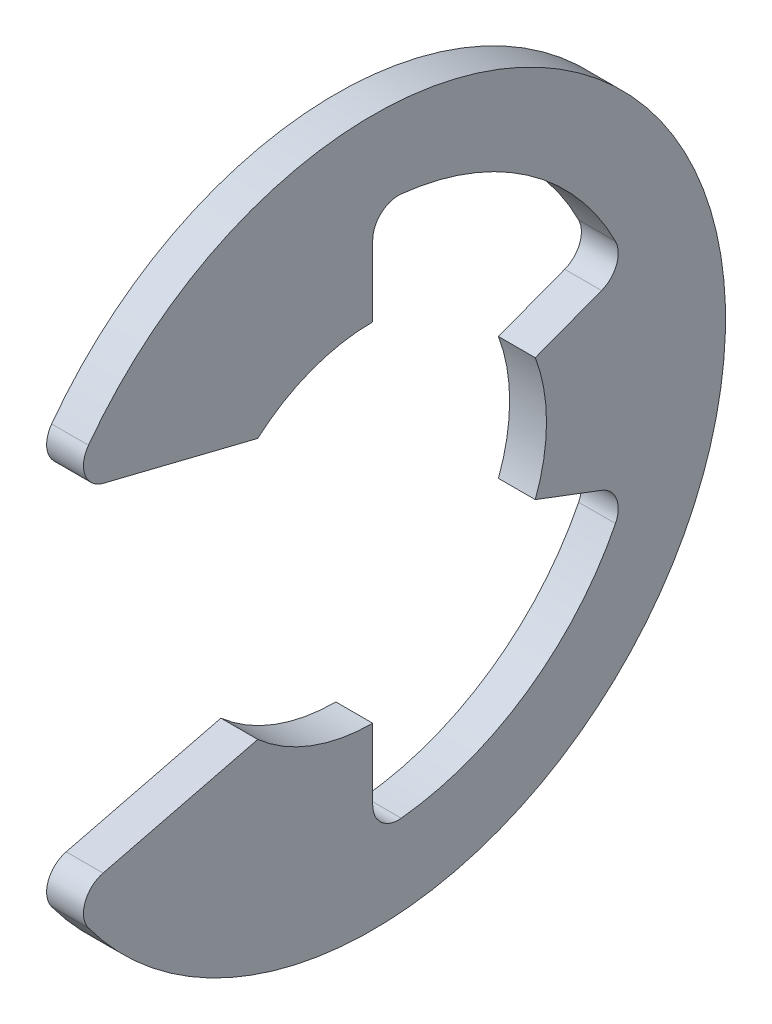
ISO-10303-21;
HEADER;
FILE_DESCRIPTION(('STEP AP214'),'2;1');
FILE_NAME('part.step','',(''),(''),'','','');
FILE_SCHEMA(('AUTOMOTIVE_DESIGN { 1 0 10303 214 1 1 1 1 }'));
ENDSEC;
DATA;
#1=APPLICATION_CONTEXT('core data for automotive mechanical design processes');
#2=APPLICATION_PROTOCOL_DEFINITION('international standard','automotive_design',2000,#1);
#3=PRODUCT_CONTEXT('',#1,'mechanical');
#4=PRODUCT('Part','Part','',(#3));
#5=PRODUCT_RELATED_PRODUCT_CATEGORY('part','',(#4));
#6=PRODUCT_DEFINITION_FORMATION('','',#4);
#7=PRODUCT_DEFINITION_CONTEXT('part definition',#1,'design');
#8=PRODUCT_DEFINITION('design','',#6,#7);
#9=PRODUCT_DEFINITION_SHAPE('','',#8);
#10=(LENGTH_UNIT() NAMED_UNIT(*) SI_UNIT(.MILLI.,.METRE.));
#11=(NAMED_UNIT(*) PLANE_ANGLE_UNIT() SI_UNIT($,.RADIAN.));
#12=(NAMED_UNIT(*) SI_UNIT($,.STERADIAN.) SOLID_ANGLE_UNIT());
#13=UNCERTAINTY_MEASURE_WITH_UNIT(LENGTH_MEASURE(1.E-05),#10,'distance_accuracy_value','');
#14=(GEOMETRIC_REPRESENTATION_CONTEXT(3) GLOBAL_UNCERTAINTY_ASSIGNED_CONTEXT((#13)) GLOBAL_UNIT_ASSIGNED_CONTEXT((#10,
#11,#12)) REPRESENTATION_CONTEXT('',''));
#15=CARTESIAN_POINT('',(0.,0.,0.));
#16=DIRECTION('',(0.,0.,1.));
#17=DIRECTION('',(1.,0.,0.));
#18=AXIS2_PLACEMENT_3D('',#15,#16,#17);
#19=CARTESIAN_POINT('',(0.5334,0.,0.));
#20=DIRECTION('',(1.,0.,0.));
#21=DIRECTION('',(0.,0.,-1.));
#22=AXIS2_PLACEMENT_3D('',#19,#20,#21);
#23=PLANE('',#22);
#24=DIRECTION('',(0.,-1.,0.));
#25=VECTOR('',#24,1.);
#26=CARTESIAN_POINT('',(0.5334,-5.0292,0.));
#27=LINE('',#26,#25);
#28=CARTESIAN_POINT('',(0.5334,-7.07977202193844,0.));
#29=VERTEX_POINT('',#28);
#30=CARTESIAN_POINT('',(0.5334,-5.0292,0.));
#31=VERTEX_POINT('',#30);
#32=EDGE_CURVE('E167',#29,#31,#27,.F.);
#33=ORIENTED_EDGE('',*,*,#32,.T.);
#34=CARTESIAN_POINT('',(0.5334,0.,0.));
#35=DIRECTION('',(-1.,0.,0.));
#36=DIRECTION('',(0.,0.,1.));
#37=AXIS2_PLACEMENT_3D('',#34,#35,#36);
#38=CIRCLE('',#37,5.0292);
#39=CARTESIAN_POINT('',(0.5334,-3.7719,3.32650312340151));
#40=VERTEX_POINT('',#39);
#41=EDGE_CURVE('E223',#31,#40,#38,.T.);
#42=ORIENTED_EDGE('',*,*,#41,.T.);
#43=DIRECTION('',(0.,0.240952820606873,-0.970536829925373));
#44=VECTOR('',#43,1.);
#45=CARTESIAN_POINT('',(0.5334,-5.13688856516319,8.82455735485331));
#46=LINE('',#45,#44);
#47=CARTESIAN_POINT('',(0.5334,-4.88336468232429,7.80338538873514));
#48=VERTEX_POINT('',#47);
#49=EDGE_CURVE('E162',#40,#48,#46,.F.);
#50=ORIENTED_EDGE('',*,*,#49,.T.);
#51=CARTESIAN_POINT('',(0.5334,-5.60812276543936,7.62345146041875));
#52=DIRECTION('',(-1.,0.,0.));
#53=DIRECTION('',(0.,0.,1.));
#54=AXIS2_PLACEMENT_3D('',#51,#52,#53);
#55=CIRCLE('',#54,0.746760000000001);
#56=CARTESIAN_POINT('',(0.5334,-6.05063164709239,8.22497983652265));
#57=VERTEX_POINT('',#56);
#58=EDGE_CURVE('E221',#57,#48,#55,.T.);
#59=ORIENTED_EDGE('',*,*,#58,.F.);
#60=CARTESIAN_POINT('',(0.5334,0.,0.));
#61=DIRECTION('',(-1.,0.,0.));
#62=DIRECTION('',(0.,0.,1.));
#63=AXIS2_PLACEMENT_3D('',#60,#61,#62);
#64=CIRCLE('',#63,10.2108);
#65=CARTESIAN_POINT('',(0.5334,6.05063164709238,8.22497983652265));
#66=VERTEX_POINT('',#65);
#67=EDGE_CURVE('E142',#66,#57,#64,.T.);
#68=ORIENTED_EDGE('',*,*,#67,.F.);
#69=CARTESIAN_POINT('',(0.5334,5.60812276543936,7.62345146041875));
#70=DIRECTION('',(-1.,0.,0.));
#71=DIRECTION('',(0.,0.,1.));
#72=AXIS2_PLACEMENT_3D('',#69,#70,#71);
#73=CIRCLE('',#72,0.74676);
#74=CARTESIAN_POINT('',(0.5334,4.88336468232429,7.80338538873514));
#75=VERTEX_POINT('',#74);
#76=EDGE_CURVE('E20',#75,#66,#73,.T.);
#77=ORIENTED_EDGE('',*,*,#76,.F.);
#78=DIRECTION('',(0.,0.240952820606873,0.970536829925373));
#79=VECTOR('',#78,1.);
#80=CARTESIAN_POINT('',(0.5334,5.13688856516319,8.82455735485332));
#81=LINE('',#80,#79);
#82=CARTESIAN_POINT('',(0.5334,3.7719,3.32650312340151));
#83=VERTEX_POINT('',#82);
#84=EDGE_CURVE('E139',#75,#83,#81,.F.);
#85=ORIENTED_EDGE('',*,*,#84,.T.);
#86=CARTESIAN_POINT('',(0.5334,0.,0.));
#87=DIRECTION('',(-1.,0.,0.));
#88=DIRECTION('',(0.,0.,1.));
#89=AXIS2_PLACEMENT_3D('',#86,#87,#88);
#90=CIRCLE('',#89,5.0292);
#91=CARTESIAN_POINT('',(0.5334,5.0292,0.));
#92=VERTEX_POINT('',#91);
#93=EDGE_CURVE('E242',#83,#92,#90,.T.);
#94=ORIENTED_EDGE('',*,*,#93,.T.);
#95=DIRECTION('',(0.,-1.,0.));
#96=VECTOR('',#95,1.);
#97=CARTESIAN_POINT('',(0.5334,5.0292,0.));
#98=LINE('',#97,#96);
#99=CARTESIAN_POINT('',(0.5334,7.07977202193844,0.));
#100=VERTEX_POINT('',#99);
#101=EDGE_CURVE('E179',#92,#100,#98,.F.);
#102=ORIENTED_EDGE('',*,*,#101,.T.);
#103=CARTESIAN_POINT('',(0.5334,7.07977202193844,-0.746759999999999));
#104=DIRECTION('',(-1.,0.,0.));
#105=DIRECTION('',(0.,0.,1.));
#106=AXIS2_PLACEMENT_3D('',#103,#104,#105);
#107=CIRCLE('',#106,0.74676);
#108=CARTESIAN_POINT('',(0.5334,7.82241228858608,-0.825092189765899));
#109=VERTEX_POINT('',#108);
#110=EDGE_CURVE('E241',#100,#109,#107,.T.);
#111=ORIENTED_EDGE('',*,*,#110,.T.);
#112=CARTESIAN_POINT('',(0.5334,0.,0.));
#113=DIRECTION('',(-1.,0.,0.));
#114=DIRECTION('',(0.,0.,1.));
#115=AXIS2_PLACEMENT_3D('',#112,#113,#114);
#116=CIRCLE('',#115,7.8658064516129);
#117=CARTESIAN_POINT('',(0.5334,3.53744345889987,-7.02548253925108));
#118=VERTEX_POINT('',#117);
#119=EDGE_CURVE('E238',#109,#118,#116,.T.);
#120=ORIENTED_EDGE('',*,*,#119,.T.);
#121=CARTESIAN_POINT('',(0.5334,3.20160742052056,-6.35850079068093));
#122=DIRECTION('',(-1.,0.,0.));
#123=DIRECTION('',(0.,0.,1.));
#124=AXIS2_PLACEMENT_3D('',#121,#122,#123);
#125=CIRCLE('',#124,0.74676);
#126=CARTESIAN_POINT('',(0.5334,2.50307740298373,-6.62252032064036));
#127=VERTEX_POINT('',#126);
#128=EDGE_CURVE('E235',#118,#127,#125,.T.);
#129=ORIENTED_EDGE('',*,*,#128,.T.);
#130=DIRECTION('',(0.,0.353553390593273,-0.935414346693486));
#131=VECTOR('',#130,1.);
#132=CARTESIAN_POINT('',(0.5334,1.77809071197169,-4.70438583239088));
#133=LINE('',#132,#131);
#134=CARTESIAN_POINT('',(0.5334,1.77809071197169,-4.70438583239087));
#135=VERTEX_POINT('',#134);
#136=EDGE_CURVE('E175',#127,#135,#133,.F.);
#137=ORIENTED_EDGE('',*,*,#136,.T.);
#138=CARTESIAN_POINT('',(0.5334,0.,0.));
#139=DIRECTION('',(-1.,0.,0.));
#140=DIRECTION('',(0.,0.,1.));
#141=AXIS2_PLACEMENT_3D('',#138,#139,#140);
#142=CIRCLE('',#141,5.0292);
#143=CARTESIAN_POINT('',(0.5334,-1.77809071197169,-4.70438583239088));
#144=VERTEX_POINT('',#143);
#145=EDGE_CURVE('E233',#135,#144,#142,.T.);
#146=ORIENTED_EDGE('',*,*,#145,.T.);
#147=DIRECTION('',(0.,0.353553390593273,0.935414346693486));
#148=VECTOR('',#147,1.);
#149=CARTESIAN_POINT('',(0.5334,-1.77809071197169,-4.70438583239088));
#150=LINE('',#149,#148);
#151=CARTESIAN_POINT('',(0.5334,-2.50307740298373,-6.62252032064036));
#152=VERTEX_POINT('',#151);
#153=EDGE_CURVE('E171',#144,#152,#150,.F.);
#154=ORIENTED_EDGE('',*,*,#153,.T.);
#155=CARTESIAN_POINT('',(0.5334,-3.20160742052056,-6.35850079068093));
#156=DIRECTION('',(-1.,0.,0.));
#157=DIRECTION('',(0.,0.,1.));
#158=AXIS2_PLACEMENT_3D('',#155,#156,#157);
#159=CIRCLE('',#158,0.74676);
#160=CARTESIAN_POINT('',(0.5334,-3.53744345889986,-7.02548253925108));
#161=VERTEX_POINT('',#160);
#162=EDGE_CURVE('E231',#152,#161,#159,.T.);
#163=ORIENTED_EDGE('',*,*,#162,.T.);
#164=CARTESIAN_POINT('',(0.5334,0.,0.));
#165=DIRECTION('',(-1.,0.,0.));
#166=DIRECTION('',(0.,0.,1.));
#167=AXIS2_PLACEMENT_3D('',#164,#165,#166);
#168=CIRCLE('',#167,7.8658064516129);
#169=CARTESIAN_POINT('',(0.5334,-7.82241228858608,-0.825092189765901));
#170=VERTEX_POINT('',#169);
#171=EDGE_CURVE('E228',#161,#170,#168,.T.);
#172=ORIENTED_EDGE('',*,*,#171,.T.);
#173=CARTESIAN_POINT('',(0.5334,-7.07977202193844,-0.74676));
#174=DIRECTION('',(-1.,0.,0.));
#175=DIRECTION('',(0.,0.,1.));
#176=AXIS2_PLACEMENT_3D('',#173,#174,#175);
#177=CIRCLE('',#176,0.74676);
#178=EDGE_CURVE('E225',#170,#29,#177,.T.);
#179=ORIENTED_EDGE('',*,*,#178,.T.);
#180=EDGE_LOOP('',(#33,#42,#50,#59,#68,#77,#85,#94,#102,#111,#120,#129,#137,#146,#154,#163,#172,#179));
#181=FACE_BOUND('',#180,.T.);
#182=ADVANCED_FACE('F17',(#181),#23,.T.);
#183=CARTESIAN_POINT('',(0.5334,5.60812276543936,7.62345146041875));
#184=DIRECTION('',(-1.,0.,0.));
#185=DIRECTION('',(0.,0.,1.));
#186=AXIS2_PLACEMENT_3D('',#183,#184,#185);
#187=CYLINDRICAL_SURFACE('',#186,0.74676);
#188=CARTESIAN_POINT('',(-0.5334,5.60812276543936,7.62345146041875));
#189=DIRECTION('',(-1.,0.,0.));
#190=DIRECTION('',(0.,0.,1.));
#191=AXIS2_PLACEMENT_3D('',#188,#189,#190);
#192=CIRCLE('',#191,0.74676);
#193=CARTESIAN_POINT('',(-0.5334,6.05063164709238,8.22497983652265));
#194=VERTEX_POINT('',#193);
#195=CARTESIAN_POINT('',(-0.5334,4.88336468232429,7.80338538873514));
#196=VERTEX_POINT('',#195);
#197=EDGE_CURVE('E157',#194,#196,#192,.F.);
#198=ORIENTED_EDGE('',*,*,#197,.T.);
#199=DIRECTION('',(1.,0.,0.));
#200=VECTOR('',#199,1.);
#201=CARTESIAN_POINT('',(0.5334,4.88336468232429,7.80338538873514));
#202=LINE('',#201,#200);
#203=EDGE_CURVE('E147',#196,#75,#202,.T.);
#204=ORIENTED_EDGE('',*,*,#203,.T.);
#205=ORIENTED_EDGE('',*,*,#76,.T.);
#206=DIRECTION('',(-1.,0.,0.));
#207=VECTOR('',#206,1.);
#208=CARTESIAN_POINT('',(0.5334,6.05063164709238,8.22497983652265));
#209=LINE('',#208,#207);
#210=EDGE_CURVE('E218',#194,#66,#209,.F.);
#211=ORIENTED_EDGE('',*,*,#210,.F.);
#212=EDGE_LOOP('',(#198,#204,#205,#211));
#213=FACE_BOUND('',#212,.T.);
#214=ADVANCED_FACE('F156',(#213),#187,.T.);
#215=CARTESIAN_POINT('',(0.5334,5.13688856516319,8.82455735485332));
#216=DIRECTION('',(0.,0.970536829925373,-0.240952820606873));
#217=DIRECTION('',(0.,0.240952820606873,0.970536829925373));
#218=AXIS2_PLACEMENT_3D('',#215,#216,#217);
#219=PLANE('',#218);
#220=ORIENTED_EDGE('',*,*,#203,.F.);
#221=DIRECTION('',(0.,-0.240952820606873,-0.970536829925373));
#222=VECTOR('',#221,1.);
#223=CARTESIAN_POINT('',(-0.5334,4.88336468232429,7.80338538873514));
#224=LINE('',#223,#222);
#225=CARTESIAN_POINT('',(-0.5334,3.7719,3.32650312340151));
#226=VERTEX_POINT('',#225);
#227=EDGE_CURVE('E216',#196,#226,#224,.T.);
#228=ORIENTED_EDGE('',*,*,#227,.T.);
#229=DIRECTION('',(-1.,0.,0.));
#230=VECTOR('',#229,1.);
#231=CARTESIAN_POINT('',(0.5334,3.7719,3.32650312340151));
#232=LINE('',#231,#230);
#233=EDGE_CURVE('E154',#226,#83,#232,.F.);
#234=ORIENTED_EDGE('',*,*,#233,.T.);
#235=ORIENTED_EDGE('',*,*,#84,.F.);
#236=EDGE_LOOP('',(#220,#228,#234,#235));
#237=FACE_BOUND('',#236,.T.);
#238=ADVANCED_FACE('F151',(#237),#219,.F.);
#239=CARTESIAN_POINT('',(0.5334,0.,0.));
#240=DIRECTION('',(-1.,0.,0.));
#241=DIRECTION('',(0.,0.,1.));
#242=AXIS2_PLACEMENT_3D('',#239,#240,#241);
#243=CYLINDRICAL_SURFACE('',#242,5.0292);
#244=DIRECTION('',(1.,0.,0.));
#245=VECTOR('',#244,1.);
#246=CARTESIAN_POINT('',(0.5334,5.0292,0.));
#247=LINE('',#246,#245);
#248=CARTESIAN_POINT('',(-0.5334,5.0292,0.));
#249=VERTEX_POINT('',#248);
#250=EDGE_CURVE('E181',#249,#92,#247,.T.);
#251=ORIENTED_EDGE('',*,*,#250,.T.);
#252=ORIENTED_EDGE('',*,*,#93,.F.);
#253=ORIENTED_EDGE('',*,*,#233,.F.);
#254=CARTESIAN_POINT('',(-0.5334,0.,0.));
#255=DIRECTION('',(-1.,0.,0.));
#256=DIRECTION('',(0.,0.,1.));
#257=AXIS2_PLACEMENT_3D('',#254,#255,#256);
#258=CIRCLE('',#257,5.0292);
#259=EDGE_CURVE('E213',#226,#249,#258,.T.);
#260=ORIENTED_EDGE('',*,*,#259,.T.);
#261=EDGE_LOOP('',(#251,#252,#253,#260));
#262=FACE_BOUND('',#261,.T.);
#263=ADVANCED_FACE('F340',(#262),#243,.F.);
#264=CARTESIAN_POINT('',(0.5334,5.0292,0.));
#265=DIRECTION('',(0.,0.,1.));
#266=DIRECTION('',(0.,-1.,0.));
#267=AXIS2_PLACEMENT_3D('',#264,#265,#266);
#268=PLANE('',#267);
#269=DIRECTION('',(-1.,0.,0.));
#270=VECTOR('',#269,1.);
#271=CARTESIAN_POINT('',(0.5334,7.07977202193844,0.));
#272=LINE('',#271,#270);
#273=CARTESIAN_POINT('',(-0.5334,7.07977202193844,0.));
#274=VERTEX_POINT('',#273);
#275=EDGE_CURVE('E180',#274,#100,#272,.F.);
#276=ORIENTED_EDGE('',*,*,#275,.T.);
#277=ORIENTED_EDGE('',*,*,#101,.F.);
#278=ORIENTED_EDGE('',*,*,#250,.F.);
#279=DIRECTION('',(0.,1.,0.));
#280=VECTOR('',#279,1.);
#281=CARTESIAN_POINT('',(-0.5334,0.,0.));
#282=LINE('',#281,#280);
#283=EDGE_CURVE('E212',#249,#274,#282,.T.);
#284=ORIENTED_EDGE('',*,*,#283,.T.);
#285=EDGE_LOOP('',(#276,#277,#278,#284));
#286=FACE_BOUND('',#285,.T.);
#287=ADVANCED_FACE('F338',(#286),#268,.F.);
#288=CARTESIAN_POINT('',(0.5334,7.07977202193844,-0.746759999999999));
#289=DIRECTION('',(-1.,0.,0.));
#290=DIRECTION('',(0.,0.,1.));
#291=AXIS2_PLACEMENT_3D('',#288,#289,#290);
#292=CYLINDRICAL_SURFACE('',#291,0.74676);
#293=ORIENTED_EDGE('',*,*,#275,.F.);
#294=CARTESIAN_POINT('',(-0.5334,7.07977202193844,-0.746759999999999));
#295=DIRECTION('',(-1.,0.,0.));
#296=DIRECTION('',(0.,0.,1.));
#297=AXIS2_PLACEMENT_3D('',#294,#295,#296);
#298=CIRCLE('',#297,0.74676);
#299=CARTESIAN_POINT('',(-0.5334,7.82241228858608,-0.825092189765899));
#300=VERTEX_POINT('',#299);
#301=EDGE_CURVE('E209',#274,#300,#298,.T.);
#302=ORIENTED_EDGE('',*,*,#301,.T.);
#303=DIRECTION('',(-1.,0.,0.));
#304=VECTOR('',#303,1.);
#305=CARTESIAN_POINT('',(0.5334,7.82241228858608,-0.8250921897659));
#306=LINE('',#305,#304);
#307=EDGE_CURVE('E240',#300,#109,#306,.F.);
#308=ORIENTED_EDGE('',*,*,#307,.T.);
#309=ORIENTED_EDGE('',*,*,#110,.F.);
#310=EDGE_LOOP('',(#293,#302,#308,#309));
#311=FACE_BOUND('',#310,.T.);
#312=ADVANCED_FACE('F335',(#311),#292,.F.);
#313=CARTESIAN_POINT('',(0.5334,0.,0.));
#314=DIRECTION('',(-1.,0.,0.));
#315=DIRECTION('',(0.,0.,1.));
#316=AXIS2_PLACEMENT_3D('',#313,#314,#315);
#317=CYLINDRICAL_SURFACE('',#316,7.8658064516129);
#318=ORIENTED_EDGE('',*,*,#307,.F.);
#319=CARTESIAN_POINT('',(-0.5334,0.,0.));
#320=DIRECTION('',(-1.,0.,0.));
#321=DIRECTION('',(0.,0.,1.));
#322=AXIS2_PLACEMENT_3D('',#319,#320,#321);
#323=CIRCLE('',#322,7.8658064516129);
#324=CARTESIAN_POINT('',(-0.5334,3.53744345889986,-7.02548253925108));
#325=VERTEX_POINT('',#324);
#326=EDGE_CURVE('E206',#300,#325,#323,.T.);
#327=ORIENTED_EDGE('',*,*,#326,.T.);
#328=DIRECTION('',(-1.,0.,0.));
#329=VECTOR('',#328,1.);
#330=CARTESIAN_POINT('',(0.5334,3.53744345889986,-7.02548253925108));
#331=LINE('',#330,#329);
#332=EDGE_CURVE('E237',#325,#118,#331,.F.);
#333=ORIENTED_EDGE('',*,*,#332,.T.);
#334=ORIENTED_EDGE('',*,*,#119,.F.);
#335=EDGE_LOOP('',(#318,#327,#333,#334));
#336=FACE_BOUND('',#335,.T.);
#337=ADVANCED_FACE('F331',(#336),#317,.F.);
#338=CARTESIAN_POINT('',(0.5334,3.20160742052056,-6.35850079068093));
#339=DIRECTION('',(-1.,0.,0.));
#340=DIRECTION('',(0.,0.,1.));
#341=AXIS2_PLACEMENT_3D('',#338,#339,#340);
#342=CYLINDRICAL_SURFACE('',#341,0.74676);
#343=ORIENTED_EDGE('',*,*,#332,.F.);
#344=CARTESIAN_POINT('',(-0.5334,3.20160742052056,-6.35850079068093));
#345=DIRECTION('',(-1.,0.,0.));
#346=DIRECTION('',(0.,0.,1.));
#347=AXIS2_PLACEMENT_3D('',#344,#345,#346);
#348=CIRCLE('',#347,0.74676);
#349=CARTESIAN_POINT('',(-0.5334,2.50307740298373,-6.62252032064036));
#350=VERTEX_POINT('',#349);
#351=EDGE_CURVE('E203',#325,#350,#348,.T.);
#352=ORIENTED_EDGE('',*,*,#351,.T.);
#353=DIRECTION('',(1.,0.,0.));
#354=VECTOR('',#353,1.);
#355=CARTESIAN_POINT('',(0.5334,2.50307740298373,-6.62252032064036));
#356=LINE('',#355,#354);
#357=EDGE_CURVE('E178',#350,#127,#356,.T.);
#358=ORIENTED_EDGE('',*,*,#357,.T.);
#359=ORIENTED_EDGE('',*,*,#128,.F.);
#360=EDGE_LOOP('',(#343,#352,#358,#359));
#361=FACE_BOUND('',#360,.T.);
#362=ADVANCED_FACE('F327',(#361),#342,.F.);
#363=CARTESIAN_POINT('',(0.5334,1.77809071197169,-4.70438583239088));
#364=DIRECTION('',(0.,-0.935414346693486,-0.353553390593273));
#365=DIRECTION('',(0.,0.353553390593273,-0.935414346693486));
#366=AXIS2_PLACEMENT_3D('',#363,#364,#365);
#367=PLANE('',#366);
#368=ORIENTED_EDGE('',*,*,#357,.F.);
#369=DIRECTION('',(0.,-0.353553390593273,0.935414346693486));
#370=VECTOR('',#369,1.);
#371=CARTESIAN_POINT('',(-0.5334,2.50307740298373,-6.62252032064036));
#372=LINE('',#371,#370);
#373=CARTESIAN_POINT('',(-0.5334,1.77809071197169,-4.70438583239087));
#374=VERTEX_POINT('',#373);
#375=EDGE_CURVE('E202',#350,#374,#372,.T.);
#376=ORIENTED_EDGE('',*,*,#375,.T.);
#377=DIRECTION('',(-1.,0.,0.));
#378=VECTOR('',#377,1.);
#379=CARTESIAN_POINT('',(0.5334,1.77809071197169,-4.70438583239087));
#380=LINE('',#379,#378);
#381=EDGE_CURVE('E177',#374,#135,#380,.F.);
#382=ORIENTED_EDGE('',*,*,#381,.T.);
#383=ORIENTED_EDGE('',*,*,#136,.F.);
#384=EDGE_LOOP('',(#368,#376,#382,#383));
#385=FACE_BOUND('',#384,.T.);
#386=ADVANCED_FACE('F323',(#385),#367,.F.);
#387=CARTESIAN_POINT('',(0.5334,0.,0.));
#388=DIRECTION('',(-1.,0.,0.));
#389=DIRECTION('',(0.,0.,1.));
#390=AXIS2_PLACEMENT_3D('',#387,#388,#389);
#391=CYLINDRICAL_SURFACE('',#390,5.0292);
#392=DIRECTION('',(1.,0.,0.));
#393=VECTOR('',#392,1.);
#394=CARTESIAN_POINT('',(0.5334,-1.77809071197169,-4.70438583239088));
#395=LINE('',#394,#393);
#396=CARTESIAN_POINT('',(-0.5334,-1.77809071197169,-4.70438583239088));
#397=VERTEX_POINT('',#396);
#398=EDGE_CURVE('E174',#397,#144,#395,.T.);
#399=ORIENTED_EDGE('',*,*,#398,.T.);
#400=ORIENTED_EDGE('',*,*,#145,.F.);
#401=ORIENTED_EDGE('',*,*,#381,.F.);
#402=CARTESIAN_POINT('',(-0.5334,0.,0.));
#403=DIRECTION('',(-1.,0.,0.));
#404=DIRECTION('',(0.,0.,1.));
#405=AXIS2_PLACEMENT_3D('',#402,#403,#404);
#406=CIRCLE('',#405,5.0292);
#407=EDGE_CURVE('E199',#374,#397,#406,.T.);
#408=ORIENTED_EDGE('',*,*,#407,.T.);
#409=EDGE_LOOP('',(#399,#400,#401,#408));
#410=FACE_BOUND('',#409,.T.);
#411=ADVANCED_FACE('F319',(#410),#391,.F.);
#412=CARTESIAN_POINT('',(0.5334,-1.77809071197169,-4.70438583239088));
#413=DIRECTION('',(0.,0.935414346693486,-0.353553390593273));
#414=DIRECTION('',(0.,0.353553390593273,0.935414346693486));
#415=AXIS2_PLACEMENT_3D('',#412,#413,#414);
#416=PLANE('',#415);
#417=DIRECTION('',(-1.,0.,0.));
#418=VECTOR('',#417,1.);
#419=CARTESIAN_POINT('',(0.5334,-2.50307740298373,-6.62252032064036));
#420=LINE('',#419,#418);
#421=CARTESIAN_POINT('',(-0.5334,-2.50307740298373,-6.62252032064036));
#422=VERTEX_POINT('',#421);
#423=EDGE_CURVE('E173',#422,#152,#420,.F.);
#424=ORIENTED_EDGE('',*,*,#423,.T.);
#425=ORIENTED_EDGE('',*,*,#153,.F.);
#426=ORIENTED_EDGE('',*,*,#398,.F.);
#427=DIRECTION('',(0.,-0.353553390593273,-0.935414346693486));
#428=VECTOR('',#427,1.);
#429=CARTESIAN_POINT('',(-0.5334,-1.77809071197169,-4.70438583239088));
#430=LINE('',#429,#428);
#431=EDGE_CURVE('E198',#397,#422,#430,.T.);
#432=ORIENTED_EDGE('',*,*,#431,.T.);
#433=EDGE_LOOP('',(#424,#425,#426,#432));
#434=FACE_BOUND('',#433,.T.);
#435=ADVANCED_FACE('F315',(#434),#416,.F.);
#436=CARTESIAN_POINT('',(0.5334,-3.20160742052056,-6.35850079068093));
#437=DIRECTION('',(-1.,0.,0.));
#438=DIRECTION('',(0.,0.,1.));
#439=AXIS2_PLACEMENT_3D('',#436,#437,#438);
#440=CYLINDRICAL_SURFACE('',#439,0.74676);
#441=ORIENTED_EDGE('',*,*,#423,.F.);
#442=CARTESIAN_POINT('',(-0.5334,-3.20160742052056,-6.35850079068093));
#443=DIRECTION('',(-1.,0.,0.));
#444=DIRECTION('',(0.,0.,1.));
#445=AXIS2_PLACEMENT_3D('',#442,#443,#444);
#446=CIRCLE('',#445,0.74676);
#447=CARTESIAN_POINT('',(-0.5334,-3.53744345889986,-7.02548253925108));
#448=VERTEX_POINT('',#447);
#449=EDGE_CURVE('E195',#422,#448,#446,.T.);
#450=ORIENTED_EDGE('',*,*,#449,.T.);
#451=DIRECTION('',(-1.,0.,0.));
#452=VECTOR('',#451,1.);
#453=CARTESIAN_POINT('',(0.5334,-3.53744345889986,-7.02548253925108));
#454=LINE('',#453,#452);
#455=EDGE_CURVE('E230',#448,#161,#454,.F.);
#456=ORIENTED_EDGE('',*,*,#455,.T.);
#457=ORIENTED_EDGE('',*,*,#162,.F.);
#458=EDGE_LOOP('',(#441,#450,#456,#457));
#459=FACE_BOUND('',#458,.T.);
#460=ADVANCED_FACE('F311',(#459),#440,.F.);
#461=CARTESIAN_POINT('',(0.5334,0.,0.));
#462=DIRECTION('',(-1.,0.,0.));
#463=DIRECTION('',(0.,0.,1.));
#464=AXIS2_PLACEMENT_3D('',#461,#462,#463);
#465=CYLINDRICAL_SURFACE('',#464,7.8658064516129);
#466=DIRECTION('',(-1.,0.,0.));
#467=VECTOR('',#466,1.);
#468=CARTESIAN_POINT('',(0.5334,-7.82241228858608,-0.825092189765901));
#469=LINE('',#468,#467);
#470=CARTESIAN_POINT('',(-0.5334,-7.82241228858608,-0.825092189765901));
#471=VERTEX_POINT('',#470);
#472=EDGE_CURVE('E227',#471,#170,#469,.F.);
#473=ORIENTED_EDGE('',*,*,#472,.T.);
#474=ORIENTED_EDGE('',*,*,#171,.F.);
#475=ORIENTED_EDGE('',*,*,#455,.F.);
#476=CARTESIAN_POINT('',(-0.5334,0.,0.));
#477=DIRECTION('',(-1.,0.,0.));
#478=DIRECTION('',(0.,0.,1.));
#479=AXIS2_PLACEMENT_3D('',#476,#477,#478);
#480=CIRCLE('',#479,7.8658064516129);
#481=EDGE_CURVE('E192',#448,#471,#480,.T.);
#482=ORIENTED_EDGE('',*,*,#481,.T.);
#483=EDGE_LOOP('',(#473,#474,#475,#482));
#484=FACE_BOUND('',#483,.T.);
#485=ADVANCED_FACE('F307',(#484),#465,.F.);
#486=CARTESIAN_POINT('',(0.5334,-7.07977202193844,-0.74676));
#487=DIRECTION('',(-1.,0.,0.));
#488=DIRECTION('',(0.,0.,1.));
#489=AXIS2_PLACEMENT_3D('',#486,#487,#488);
#490=CYLINDRICAL_SURFACE('',#489,0.74676);
#491=ORIENTED_EDGE('',*,*,#472,.F.);
#492=CARTESIAN_POINT('',(-0.5334,-7.07977202193844,-0.74676));
#493=DIRECTION('',(-1.,0.,0.));
#494=DIRECTION('',(0.,0.,1.));
#495=AXIS2_PLACEMENT_3D('',#492,#493,#494);
#496=CIRCLE('',#495,0.74676);
#497=CARTESIAN_POINT('',(-0.5334,-7.07977202193844,0.));
#498=VERTEX_POINT('',#497);
#499=EDGE_CURVE('E189',#471,#498,#496,.T.);
#500=ORIENTED_EDGE('',*,*,#499,.T.);
#501=DIRECTION('',(1.,0.,0.));
#502=VECTOR('',#501,1.);
#503=CARTESIAN_POINT('',(0.5334,-7.07977202193844,0.));
#504=LINE('',#503,#502);
#505=EDGE_CURVE('E170',#498,#29,#504,.T.);
#506=ORIENTED_EDGE('',*,*,#505,.T.);
#507=ORIENTED_EDGE('',*,*,#178,.F.);
#508=EDGE_LOOP('',(#491,#500,#506,#507));
#509=FACE_BOUND('',#508,.T.);
#510=ADVANCED_FACE('F303',(#509),#490,.F.);
#511=CARTESIAN_POINT('',(0.5334,-5.0292,0.));
#512=DIRECTION('',(0.,0.,1.));
#513=DIRECTION('',(0.,-1.,0.));
#514=AXIS2_PLACEMENT_3D('',#511,#512,#513);
#515=PLANE('',#514);
#516=ORIENTED_EDGE('',*,*,#505,.F.);
#517=DIRECTION('',(0.,1.,0.));
#518=VECTOR('',#517,1.);
#519=CARTESIAN_POINT('',(-0.5334,0.,0.));
#520=LINE('',#519,#518);
#521=CARTESIAN_POINT('',(-0.5334,-5.0292,0.));
#522=VERTEX_POINT('',#521);
#523=EDGE_CURVE('E188',#498,#522,#520,.T.);
#524=ORIENTED_EDGE('',*,*,#523,.T.);
#525=DIRECTION('',(-1.,0.,0.));
#526=VECTOR('',#525,1.);
#527=CARTESIAN_POINT('',(0.5334,-5.0292,0.));
#528=LINE('',#527,#526);
#529=EDGE_CURVE('E169',#522,#31,#528,.F.);
#530=ORIENTED_EDGE('',*,*,#529,.T.);
#531=ORIENTED_EDGE('',*,*,#32,.F.);
#532=EDGE_LOOP('',(#516,#524,#530,#531));
#533=FACE_BOUND('',#532,.T.);
#534=ADVANCED_FACE('F299',(#533),#515,.F.);
#535=CARTESIAN_POINT('',(0.5334,0.,0.));
#536=DIRECTION('',(-1.,0.,0.));
#537=DIRECTION('',(0.,0.,1.));
#538=AXIS2_PLACEMENT_3D('',#535,#536,#537);
#539=CYLINDRICAL_SURFACE('',#538,5.0292);
#540=DIRECTION('',(1.,0.,0.));
#541=VECTOR('',#540,1.);
#542=CARTESIAN_POINT('',(0.5334,-3.7719,3.32650312340151));
#543=LINE('',#542,#541);
#544=CARTESIAN_POINT('',(-0.5334,-3.7719,3.32650312340151));
#545=VERTEX_POINT('',#544);
#546=EDGE_CURVE('E166',#545,#40,#543,.T.);
#547=ORIENTED_EDGE('',*,*,#546,.T.);
#548=ORIENTED_EDGE('',*,*,#41,.F.);
#549=ORIENTED_EDGE('',*,*,#529,.F.);
#550=CARTESIAN_POINT('',(-0.5334,0.,0.));
#551=DIRECTION('',(-1.,0.,0.));
#552=DIRECTION('',(0.,0.,1.));
#553=AXIS2_PLACEMENT_3D('',#550,#551,#552);
#554=CIRCLE('',#553,5.0292);
#555=EDGE_CURVE('E185',#522,#545,#554,.T.);
#556=ORIENTED_EDGE('',*,*,#555,.T.);
#557=EDGE_LOOP('',(#547,#548,#549,#556));
#558=FACE_BOUND('',#557,.T.);
#559=ADVANCED_FACE('F295',(#558),#539,.F.);
#560=CARTESIAN_POINT('',(0.5334,-5.13688856516319,8.82455735485331));
#561=DIRECTION('',(0.,-0.970536829925373,-0.240952820606873));
#562=DIRECTION('',(0.,0.240952820606873,-0.970536829925373));
#563=AXIS2_PLACEMENT_3D('',#560,#561,#562);
#564=PLANE('',#563);
#565=DIRECTION('',(-1.,0.,0.));
#566=VECTOR('',#565,1.);
#567=CARTESIAN_POINT('',(0.5334,-4.88336468232429,7.80338538873514));
#568=LINE('',#567,#566);
#569=CARTESIAN_POINT('',(-0.5334,-4.88336468232429,7.80338538873514));
#570=VERTEX_POINT('',#569);
#571=EDGE_CURVE('E165',#48,#570,#568,.T.);
#572=ORIENTED_EDGE('',*,*,#571,.F.);
#573=ORIENTED_EDGE('',*,*,#49,.F.);
#574=ORIENTED_EDGE('',*,*,#546,.F.);
#575=DIRECTION('',(0.,-0.240952820606873,0.970536829925373));
#576=VECTOR('',#575,1.);
#577=CARTESIAN_POINT('',(-0.5334,-3.7719,3.32650312340151));
#578=LINE('',#577,#576);
#579=EDGE_CURVE('E184',#545,#570,#578,.T.);
#580=ORIENTED_EDGE('',*,*,#579,.T.);
#581=EDGE_LOOP('',(#572,#573,#574,#580));
#582=FACE_BOUND('',#581,.T.);
#583=ADVANCED_FACE('F287',(#582),#564,.F.);
#584=CARTESIAN_POINT('',(0.5334,-5.60812276543936,7.62345146041875));
#585=DIRECTION('',(-1.,0.,0.));
#586=DIRECTION('',(0.,0.,1.));
#587=AXIS2_PLACEMENT_3D('',#584,#585,#586);
#588=CYLINDRICAL_SURFACE('',#587,0.746760000000001);
#589=CARTESIAN_POINT('',(-0.5334,-5.60812276543936,7.62345146041875));
#590=DIRECTION('',(-1.,0.,0.));
#591=DIRECTION('',(0.,0.,1.));
#592=AXIS2_PLACEMENT_3D('',#589,#590,#591);
#593=CIRCLE('',#592,0.746760000000001);
#594=CARTESIAN_POINT('',(-0.5334,-6.05063164709239,8.22497983652265));
#595=VERTEX_POINT('',#594);
#596=EDGE_CURVE('E26',#570,#595,#593,.F.);
#597=ORIENTED_EDGE('',*,*,#596,.T.);
#598=DIRECTION('',(-1.,0.,0.));
#599=VECTOR('',#598,1.);
#600=CARTESIAN_POINT('',(0.5334,-6.05063164709239,8.22497983652265));
#601=LINE('',#600,#599);
#602=EDGE_CURVE('E220',#57,#595,#601,.T.);
#603=ORIENTED_EDGE('',*,*,#602,.F.);
#604=ORIENTED_EDGE('',*,*,#58,.T.);
#605=ORIENTED_EDGE('',*,*,#571,.T.);
#606=EDGE_LOOP('',(#597,#603,#604,#605));
#607=FACE_BOUND('',#606,.T.);
#608=ADVANCED_FACE('F356',(#607),#588,.T.);
#609=CARTESIAN_POINT('',(0.5334,0.,0.));
#610=DIRECTION('',(-1.,0.,0.));
#611=DIRECTION('',(0.,0.,1.));
#612=AXIS2_PLACEMENT_3D('',#609,#610,#611);
#613=CYLINDRICAL_SURFACE('',#612,10.2108);
#614=CARTESIAN_POINT('',(-0.5334,0.,0.));
#615=DIRECTION('',(-1.,0.,0.));
#616=DIRECTION('',(0.,0.,1.));
#617=AXIS2_PLACEMENT_3D('',#614,#615,#616);
#618=CIRCLE('',#617,10.2108);
#619=EDGE_CURVE('E11',#595,#194,#618,.F.);
#620=ORIENTED_EDGE('',*,*,#619,.T.);
#621=ORIENTED_EDGE('',*,*,#210,.T.);
#622=ORIENTED_EDGE('',*,*,#67,.T.);
#623=ORIENTED_EDGE('',*,*,#602,.T.);
#624=EDGE_LOOP('',(#620,#621,#622,#623));
#625=FACE_BOUND('',#624,.T.);
#626=ADVANCED_FACE('F351',(#625),#613,.T.);
#627=CARTESIAN_POINT('',(-0.5334,0.,0.));
#628=DIRECTION('',(1.,0.,0.));
#629=DIRECTION('',(0.,0.,-1.));
#630=AXIS2_PLACEMENT_3D('',#627,#628,#629);
#631=PLANE('',#630);
#632=ORIENTED_EDGE('',*,*,#619,.F.);
#633=ORIENTED_EDGE('',*,*,#596,.F.);
#634=ORIENTED_EDGE('',*,*,#579,.F.);
#635=ORIENTED_EDGE('',*,*,#555,.F.);
#636=ORIENTED_EDGE('',*,*,#523,.F.);
#637=ORIENTED_EDGE('',*,*,#499,.F.);
#638=ORIENTED_EDGE('',*,*,#481,.F.);
#639=ORIENTED_EDGE('',*,*,#449,.F.);
#640=ORIENTED_EDGE('',*,*,#431,.F.);
#641=ORIENTED_EDGE('',*,*,#407,.F.);
#642=ORIENTED_EDGE('',*,*,#375,.F.);
#643=ORIENTED_EDGE('',*,*,#351,.F.);
#644=ORIENTED_EDGE('',*,*,#326,.F.);
#645=ORIENTED_EDGE('',*,*,#301,.F.);
#646=ORIENTED_EDGE('',*,*,#283,.F.);
#647=ORIENTED_EDGE('',*,*,#259,.F.);
#648=ORIENTED_EDGE('',*,*,#227,.F.);
#649=ORIENTED_EDGE('',*,*,#197,.F.);
#650=EDGE_LOOP('',(#632,#633,#634,#635,#636,#637,#638,#639,#640,#641,#642,#643,#644,#645,#646,
#647,#648,#649));
#651=FACE_BOUND('',#650,.T.);
#652=ADVANCED_FACE('F292',(#651),#631,.F.);
#653=CLOSED_SHELL('',(#182,#214,#238,#263,#287,#312,#337,#362,#386,#411,#435,#460,#485,#510,
#534,#559,#583,#608,#626,#652));
#654=MANIFOLD_SOLID_BREP('B1',#653);
#655=ADVANCED_BREP_SHAPE_REPRESENTATION('',(#18,#654),#14);
#656=SHAPE_DEFINITION_REPRESENTATION(#9,#655);
ENDSEC;
END-ISO-10303-21;
